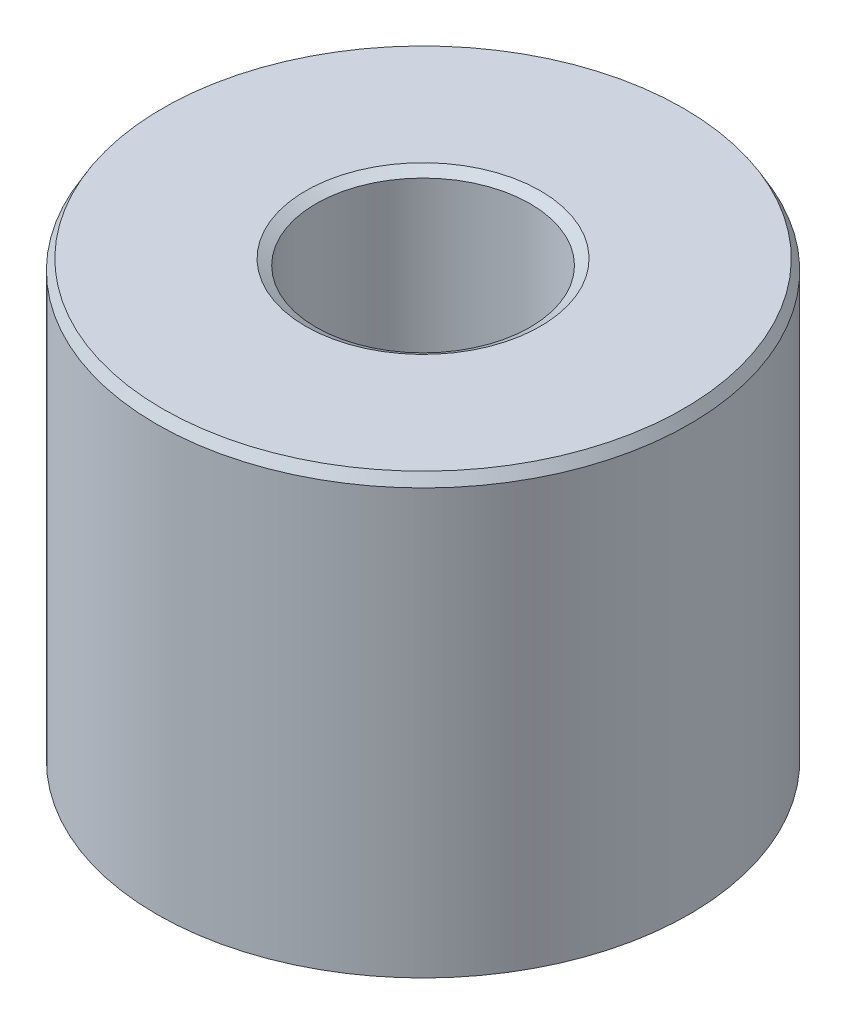
ISO-10303-21;
HEADER;
FILE_DESCRIPTION(('STEP AP214'),'2;1');
FILE_NAME('part.step','',(''),(''),'','','');
FILE_SCHEMA(('AUTOMOTIVE_DESIGN { 1 0 10303 214 1 1 1 1 }'));
ENDSEC;
DATA;
#1=APPLICATION_CONTEXT('core data for automotive mechanical design processes');
#2=APPLICATION_PROTOCOL_DEFINITION('international standard','automotive_design',2000,#1);
#3=PRODUCT_CONTEXT('',#1,'mechanical');
#4=PRODUCT('Part','Part','',(#3));
#5=PRODUCT_RELATED_PRODUCT_CATEGORY('part','',(#4));
#6=PRODUCT_DEFINITION_FORMATION('','',#4);
#7=PRODUCT_DEFINITION_CONTEXT('part definition',#1,'design');
#8=PRODUCT_DEFINITION('design','',#6,#7);
#9=PRODUCT_DEFINITION_SHAPE('','',#8);
#10=(LENGTH_UNIT() NAMED_UNIT(*) SI_UNIT(.MILLI.,.METRE.));
#11=(NAMED_UNIT(*) PLANE_ANGLE_UNIT() SI_UNIT($,.RADIAN.));
#12=(NAMED_UNIT(*) SI_UNIT($,.STERADIAN.) SOLID_ANGLE_UNIT());
#13=UNCERTAINTY_MEASURE_WITH_UNIT(LENGTH_MEASURE(1.E-05),#10,'distance_accuracy_value','');
#14=(GEOMETRIC_REPRESENTATION_CONTEXT(3) GLOBAL_UNCERTAINTY_ASSIGNED_CONTEXT((#13)) GLOBAL_UNIT_ASSIGNED_CONTEXT((#10,
#11,#12)) REPRESENTATION_CONTEXT('',''));
#15=CARTESIAN_POINT('',(0.,0.,0.));
#16=DIRECTION('',(0.,0.,1.));
#17=DIRECTION('',(1.,0.,0.));
#18=AXIS2_PLACEMENT_3D('',#15,#16,#17);
#19=CARTESIAN_POINT('',(0.,41.3612513004936,0.));
#20=DIRECTION('',(0.,-1.,0.));
#21=DIRECTION('',(0.,0.,-1.));
#22=AXIS2_PLACEMENT_3D('',#19,#20,#21);
#23=CYLINDRICAL_SURFACE('',#22,25.);
#24=CARTESIAN_POINT('',(0.,0.560106249338291,0.));
#25=DIRECTION('',(0.,1.,0.));
#26=DIRECTION('',(0.,0.,1.));
#27=AXIS2_PLACEMENT_3D('',#24,#25,#26);
#28=CIRCLE('',#27,25.);
#29=CARTESIAN_POINT('',(0.,0.560106249338291,25.));
#30=VERTEX_POINT('',#29);
#31=EDGE_CURVE('E10',#30,#30,#28,.T.);
#32=ORIENTED_EDGE('',*,*,#31,.T.);
#33=EDGE_LOOP('',(#32));
#34=FACE_BOUND('',#33,.T.);
#35=CARTESIAN_POINT('',(0.,40.3911188190029,0.));
#36=DIRECTION('',(0.,1.,0.));
#37=DIRECTION('',(0.,0.,1.));
#38=AXIS2_PLACEMENT_3D('',#35,#36,#37);
#39=CIRCLE('',#38,25.);
#40=CARTESIAN_POINT('',(0.,40.3911188190029,25.));
#41=VERTEX_POINT('',#40);
#42=EDGE_CURVE('E50',#41,#41,#39,.F.);
#43=ORIENTED_EDGE('',*,*,#42,.T.);
#44=EDGE_LOOP('',(#43));
#45=FACE_BOUND('',#44,.T.);
#46=ADVANCED_FACE('F39',(#34,#45),#23,.T.);
#47=CARTESIAN_POINT('',(0.,41.3612513004936,0.));
#48=DIRECTION('',(0.,1.,0.));
#49=DIRECTION('',(0.,0.,1.));
#50=AXIS2_PLACEMENT_3D('',#47,#48,#49);
#51=PLANE('',#50);
#52=CARTESIAN_POINT('',(0.,41.3612513004936,0.));
#53=DIRECTION('',(0.,1.,0.));
#54=DIRECTION('',(0.,0.,1.));
#55=AXIS2_PLACEMENT_3D('',#52,#53,#54);
#56=CIRCLE('',#55,11.0196823872547);
#57=CARTESIAN_POINT('',(0.,41.3612513004936,11.0196823872547));
#58=VERTEX_POINT('',#57);
#59=EDGE_CURVE('E58',#58,#58,#56,.F.);
#60=ORIENTED_EDGE('',*,*,#59,.T.);
#61=EDGE_LOOP('',(#60));
#62=FACE_BOUND('',#61,.T.);
#63=CARTESIAN_POINT('',(0.,41.3612513004936,0.));
#64=DIRECTION('',(0.,1.,0.));
#65=DIRECTION('',(0.,0.,1.));
#66=AXIS2_PLACEMENT_3D('',#63,#64,#65);
#67=CIRCLE('',#66,24.4398937506617);
#68=CARTESIAN_POINT('',(0.,41.3612513004936,24.4398937506617));
#69=VERTEX_POINT('',#68);
#70=EDGE_CURVE('E61',#69,#69,#67,.T.);
#71=ORIENTED_EDGE('',*,*,#70,.T.);
#72=EDGE_LOOP('',(#71));
#73=FACE_BOUND('',#72,.T.);
#74=ADVANCED_FACE('F88',(#62,#73),#51,.T.);
#75=CARTESIAN_POINT('',(0.,0.,0.));
#76=DIRECTION('',(0.,1.,0.));
#77=DIRECTION('',(0.,0.,1.));
#78=AXIS2_PLACEMENT_3D('',#75,#76,#77);
#79=PLANE('',#78);
#80=CARTESIAN_POINT('',(0.,0.,0.));
#81=DIRECTION('',(0.,1.,0.));
#82=DIRECTION('',(0.,0.,1.));
#83=AXIS2_PLACEMENT_3D('',#80,#81,#82);
#84=CIRCLE('',#83,10.6096561551023);
#85=CARTESIAN_POINT('',(0.,0.,-10.6096561551023));
#86=VERTEX_POINT('',#85);
#87=EDGE_CURVE('E51',#86,#86,#84,.T.);
#88=ORIENTED_EDGE('',*,*,#87,.T.);
#89=EDGE_LOOP('',(#88));
#90=FACE_BOUND('',#89,.T.);
#91=CARTESIAN_POINT('',(0.,0.,0.));
#92=DIRECTION('',(0.,1.,0.));
#93=DIRECTION('',(0.,0.,1.));
#94=AXIS2_PLACEMENT_3D('',#91,#92,#93);
#95=CIRCLE('',#94,24.0298675185092);
#96=CARTESIAN_POINT('',(0.,0.,24.0298675185092));
#97=VERTEX_POINT('',#96);
#98=EDGE_CURVE('E54',#97,#97,#95,.F.);
#99=ORIENTED_EDGE('',*,*,#98,.T.);
#100=EDGE_LOOP('',(#99));
#101=FACE_BOUND('',#100,.T.);
#102=ADVANCED_FACE('F83',(#90,#101),#79,.F.);
#103=CARTESIAN_POINT('',(0.,41.3612513004936,0.));
#104=DIRECTION('',(0.,-1.,0.));
#105=DIRECTION('',(0.,0.,-1.));
#106=AXIS2_PLACEMENT_3D('',#103,#104,#105);
#107=CYLINDRICAL_SURFACE('',#106,10.049549905764);
#108=CARTESIAN_POINT('',(0.,40.8011450511553,0.));
#109=DIRECTION('',(0.,1.,0.));
#110=DIRECTION('',(0.,0.,1.));
#111=AXIS2_PLACEMENT_3D('',#108,#109,#110);
#112=CIRCLE('',#111,10.049549905764);
#113=CARTESIAN_POINT('',(0.,40.8011450511553,10.049549905764));
#114=VERTEX_POINT('',#113);
#115=EDGE_CURVE('E67',#114,#114,#112,.T.);
#116=ORIENTED_EDGE('',*,*,#115,.T.);
#117=EDGE_LOOP('',(#116));
#118=FACE_BOUND('',#117,.T.);
#119=CARTESIAN_POINT('',(0.,0.970132481490755,0.));
#120=DIRECTION('',(0.,1.,0.));
#121=DIRECTION('',(0.,0.,1.));
#122=AXIS2_PLACEMENT_3D('',#119,#120,#121);
#123=CIRCLE('',#122,10.049549905764);
#124=CARTESIAN_POINT('',(0.,0.970132481490755,-10.049549905764));
#125=VERTEX_POINT('',#124);
#126=EDGE_CURVE('E69',#125,#125,#123,.F.);
#127=ORIENTED_EDGE('',*,*,#126,.T.);
#128=EDGE_LOOP('',(#127));
#129=FACE_BOUND('',#128,.T.);
#130=ADVANCED_FACE('F71',(#118,#129),#107,.F.);
#131=CARTESIAN_POINT('',(0.,40.8011450511553,0.));
#132=DIRECTION('',(0.,1.,0.));
#133=DIRECTION('',(0.,0.,1.));
#134=AXIS2_PLACEMENT_3D('',#131,#132,#133);
#135=CONICAL_SURFACE('',#134,10.049549905764,1.0471975511966);
#136=ORIENTED_EDGE('',*,*,#59,.F.);
#137=EDGE_LOOP('',(#136));
#138=FACE_BOUND('',#137,.T.);
#139=ORIENTED_EDGE('',*,*,#115,.F.);
#140=EDGE_LOOP('',(#139));
#141=FACE_BOUND('',#140,.T.);
#142=ADVANCED_FACE('F77',(#138,#141),#135,.F.);
#143=CARTESIAN_POINT('',(0.,0.,0.));
#144=DIRECTION('',(0.,-1.,0.));
#145=DIRECTION('',(0.,0.,-1.));
#146=AXIS2_PLACEMENT_3D('',#143,#144,#145);
#147=CONICAL_SURFACE('',#146,10.6096561551023,0.523598775598293);
#148=CARTESIAN_POINT('',(0.,0.970132481490755,-10.049549905764));
#149=CARTESIAN_POINT('',(0.,0.96002693480856,-10.0553843458613));
#150=CARTESIAN_POINT('',(0.,0.949921388126365,-10.0612187859585));
#151=CARTESIAN_POINT('',(0.,0.929710294761974,-10.0728876661531));
#152=CARTESIAN_POINT('',(0.,0.919604748079779,-10.0787221062504));
#153=CARTESIAN_POINT('',(0.,0.899393654715388,-10.0903909864449));
#154=CARTESIAN_POINT('',(0.,0.889288108033192,-10.0962254265422));
#155=CARTESIAN_POINT('',(0.,0.869077014668802,-10.1078943067367));
#156=CARTESIAN_POINT('',(0.,0.858971467986606,-10.113728746834));
#157=CARTESIAN_POINT('',(0.,0.838760374622216,-10.1253976270285));
#158=CARTESIAN_POINT('',(0.,0.82865482794002,-10.1312320671258));
#159=CARTESIAN_POINT('',(0.,0.80844373457563,-10.1429009473204));
#160=CARTESIAN_POINT('',(0.,0.798338187893434,-10.1487353874176));
#161=CARTESIAN_POINT('',(0.,0.778127094529043,-10.1604042676122));
#162=CARTESIAN_POINT('',(0.,0.768021547846848,-10.1662387077095));
#163=CARTESIAN_POINT('',(0.,0.747810454482457,-10.177907587904));
#164=CARTESIAN_POINT('',(0.,0.737704907800262,-10.1837420280013));
#165=CARTESIAN_POINT('',(0.,0.717493814435871,-10.1954109081958));
#166=CARTESIAN_POINT('',(0.,0.707388267753676,-10.2012453482931));
#167=CARTESIAN_POINT('',(0.,0.687177174389285,-10.2129142284877));
#168=CARTESIAN_POINT('',(0.,0.67707162770709,-10.2187486685849));
#169=CARTESIAN_POINT('',(0.,0.656860534342699,-10.2304175487795));
#170=CARTESIAN_POINT('',(0.,0.646754987660504,-10.2362519888768));
#171=CARTESIAN_POINT('',(0.,0.626543894296113,-10.2479208690713));
#172=CARTESIAN_POINT('',(0.,0.616438347613917,-10.2537553091686));
#173=CARTESIAN_POINT('',(0.,0.596227254249527,-10.2654241893631));
#174=CARTESIAN_POINT('',(0.,0.586121707567331,-10.2712586294604));
#175=CARTESIAN_POINT('',(0.,0.565910614202941,-10.2829275096549));
#176=CARTESIAN_POINT('',(0.,0.555805067520745,-10.2887619497522));
#177=CARTESIAN_POINT('',(0.,0.535593974156355,-10.3004308299468));
#178=CARTESIAN_POINT('',(0.,0.525488427474159,-10.306265270044));
#179=CARTESIAN_POINT('',(0.,0.505277334109768,-10.3179341502386));
#180=CARTESIAN_POINT('',(0.,0.495171787427573,-10.3237685903359));
#181=CARTESIAN_POINT('',(0.,0.474960694063182,-10.3354374705304));
#182=CARTESIAN_POINT('',(0.,0.464855147380987,-10.3412719106277));
#183=CARTESIAN_POINT('',(0.,0.444644054016596,-10.3529407908222));
#184=CARTESIAN_POINT('',(0.,0.434538507334401,-10.3587752309195));
#185=CARTESIAN_POINT('',(0.,0.41432741397001,-10.370444111114));
#186=CARTESIAN_POINT('',(0.,0.404221867287815,-10.3762785512113));
#187=CARTESIAN_POINT('',(0.,0.384010773923424,-10.3879474314059));
#188=CARTESIAN_POINT('',(0.,0.373905227241229,-10.3937818715031));
#189=CARTESIAN_POINT('',(0.,0.353694133876838,-10.4054507516977));
#190=CARTESIAN_POINT('',(0.,0.343588587194642,-10.411285191795));
#191=CARTESIAN_POINT('',(0.,0.323377493830252,-10.4229540719895));
#192=CARTESIAN_POINT('',(0.,0.313271947148056,-10.4287885120868));
#193=CARTESIAN_POINT('',(0.,0.293060853783666,-10.4404573922813));
#194=CARTESIAN_POINT('',(0.,0.28295530710147,-10.4462918323786));
#195=CARTESIAN_POINT('',(0.,0.26274421373708,-10.4579607125732));
#196=CARTESIAN_POINT('',(0.,0.252638667054884,-10.4637951526704));
#197=CARTESIAN_POINT('',(0.,0.232427573690494,-10.475464032865));
#198=CARTESIAN_POINT('',(0.,0.222322027008298,-10.4812984729622));
#199=CARTESIAN_POINT('',(0.,0.202110933643907,-10.4929673531568));
#200=CARTESIAN_POINT('',(0.,0.192005386961712,-10.4988017932541));
#201=CARTESIAN_POINT('',(0.,0.171794293597321,-10.5104706734486));
#202=CARTESIAN_POINT('',(0.,0.161688746915126,-10.5163051135459));
#203=CARTESIAN_POINT('',(0.,0.141477653550735,-10.5279739937404));
#204=CARTESIAN_POINT('',(0.,0.13137210686854,-10.5338084338377));
#205=CARTESIAN_POINT('',(0.,0.111161013504149,-10.5454773140323));
#206=CARTESIAN_POINT('',(0.,0.101055466821954,-10.5513117541295));
#207=CARTESIAN_POINT('',(0.,0.0808443734575629,-10.5629806343241));
#208=CARTESIAN_POINT('',(0.,0.0707388267753676,-10.5688150744214));
#209=CARTESIAN_POINT('',(0.,0.0505277334109769,-10.5804839546159));
#210=CARTESIAN_POINT('',(0.,0.0404221867287815,-10.5863183947132));
#211=CARTESIAN_POINT('',(0.,0.0202110933643907,-10.5979872749077));
#212=CARTESIAN_POINT('',(0.,0.0101055466821954,-10.603821715005));
#213=CARTESIAN_POINT('',(0.,0.,-10.6096561551023));
#214=B_SPLINE_CURVE_WITH_KNOTS('',3,(#148,#149,#150,#151,#152,#153,#154,#155,#156,#157,#158,
#159,#160,#161,#162,#163,#164,#165,#166,#167,#168,#169,#170,#171,#172,#173,#174,#175,#176,#177,
#178,#179,#180,#181,#182,#183,#184,#185,#186,#187,#188,#189,#190,#191,#192,#193,#194,#195,#196,
#197,#198,#199,#200,#201,#202,#203,#204,#205,#206,#207,#208,#209,#210,#211,#212,#213),
.UNSPECIFIED.,.F.,.F.,(4,2,2,2,2,2,2,2,2,2,2,2,2,2,2,2,2,2,2,2,2,2,2,2,2,2,2,2,2,2,2,2,4),(0.,
0.0350066405836428,0.0700132811672856,0.105019921750928,0.140026562334571,0.175033202918214,
0.210039843501857,0.2450464840855,0.280053124669143,0.315059765252786,0.350066405836429,
0.385073046420072,0.420079687003714,0.455086327587357,0.490092968171,0.525099608754643,
0.560106249338286,0.595112889921928,0.630119530505571,0.665126171089214,0.700132811672857,
0.735139452256499,0.770146092840142,0.805152733423785,0.840159374007428,0.875166014591071,
0.910172655174714,0.945179295758357,0.980185936341999,1.01519257692564,1.05019921750928,
1.08520585809293,1.12021249867657),.UNSPECIFIED.);
#215=EDGE_CURVE('BSEAM73',#125,#86,#214,.T.);
#216=ORIENTED_EDGE('',*,*,#126,.F.);
#217=ORIENTED_EDGE('',*,*,#87,.F.);
#218=ORIENTED_EDGE('',*,*,#215,.T.);
#219=ORIENTED_EDGE('',*,*,#215,.F.);
#220=EDGE_LOOP('',(#216,#218,#217,#219));
#221=FACE_BOUND('',#220,.T.);
#222=ADVANCED_FACE('F73',(#221),#147,.F.);
#223=CARTESIAN_POINT('',(0.,0.560106249338291,0.));
#224=DIRECTION('',(0.,1.,0.));
#225=DIRECTION('',(0.,0.,1.));
#226=AXIS2_PLACEMENT_3D('',#223,#224,#225);
#227=CONICAL_SURFACE('',#226,25.,1.0471975511966);
#228=ORIENTED_EDGE('',*,*,#98,.F.);
#229=EDGE_LOOP('',(#228));
#230=FACE_BOUND('',#229,.T.);
#231=ORIENTED_EDGE('',*,*,#31,.F.);
#232=EDGE_LOOP('',(#231));
#233=FACE_BOUND('',#232,.T.);
#234=ADVANCED_FACE('F76',(#230,#233),#227,.T.);
#235=CARTESIAN_POINT('',(0.,41.3612513004936,0.));
#236=DIRECTION('',(0.,-1.,0.));
#237=DIRECTION('',(0.,0.,-1.));
#238=AXIS2_PLACEMENT_3D('',#235,#236,#237);
#239=CONICAL_SURFACE('',#238,24.4398937506617,0.523598775598298);
#240=ORIENTED_EDGE('',*,*,#42,.F.);
#241=EDGE_LOOP('',(#240));
#242=FACE_BOUND('',#241,.T.);
#243=ORIENTED_EDGE('',*,*,#70,.F.);
#244=EDGE_LOOP('',(#243));
#245=FACE_BOUND('',#244,.T.);
#246=ADVANCED_FACE('F45',(#242,#245),#239,.T.);
#247=CLOSED_SHELL('',(#46,#74,#102,#130,#142,#222,#234,#246));
#248=MANIFOLD_SOLID_BREP('B2',#247);
#249=ADVANCED_BREP_SHAPE_REPRESENTATION('',(#18,#248),#14);
#250=SHAPE_DEFINITION_REPRESENTATION(#9,#249);
ENDSEC;
END-ISO-10303-21;
